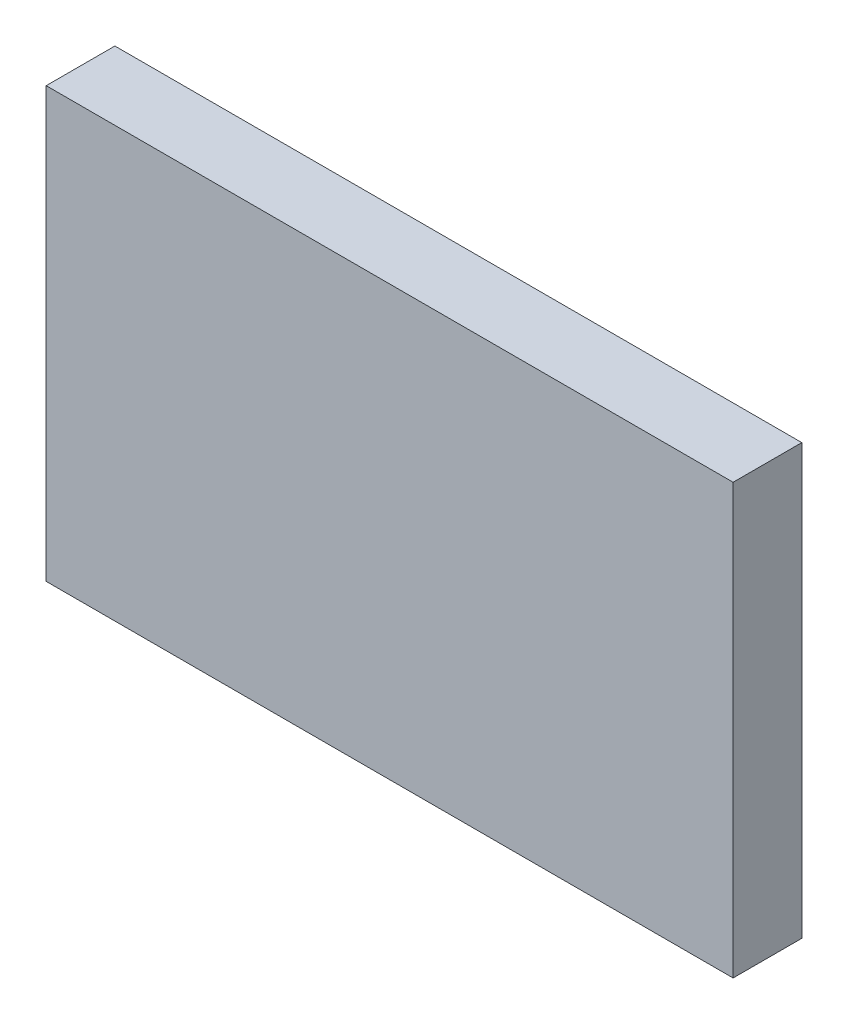
ISO-10303-21;
HEADER;
FILE_DESCRIPTION(('STEP AP214'),'2;1');
FILE_NAME('part.step','',(''),(''),'','','');
FILE_SCHEMA(('AUTOMOTIVE_DESIGN { 1 0 10303 214 1 1 1 1 }'));
ENDSEC;
DATA;
#1=APPLICATION_CONTEXT('core data for automotive mechanical design processes');
#2=APPLICATION_PROTOCOL_DEFINITION('international standard','automotive_design',2000,#1);
#3=PRODUCT_CONTEXT('',#1,'mechanical');
#4=PRODUCT('Part','Part','',(#3));
#5=PRODUCT_RELATED_PRODUCT_CATEGORY('part','',(#4));
#6=PRODUCT_DEFINITION_FORMATION('','',#4);
#7=PRODUCT_DEFINITION_CONTEXT('part definition',#1,'design');
#8=PRODUCT_DEFINITION('design','',#6,#7);
#9=PRODUCT_DEFINITION_SHAPE('','',#8);
#10=(LENGTH_UNIT() NAMED_UNIT(*) SI_UNIT(.MILLI.,.METRE.));
#11=(NAMED_UNIT(*) PLANE_ANGLE_UNIT() SI_UNIT($,.RADIAN.));
#12=(NAMED_UNIT(*) SI_UNIT($,.STERADIAN.) SOLID_ANGLE_UNIT());
#13=UNCERTAINTY_MEASURE_WITH_UNIT(LENGTH_MEASURE(1.E-05),#10,'distance_accuracy_value','');
#14=(GEOMETRIC_REPRESENTATION_CONTEXT(3) GLOBAL_UNCERTAINTY_ASSIGNED_CONTEXT((#13)) GLOBAL_UNIT_ASSIGNED_CONTEXT((#10,
#11,#12)) REPRESENTATION_CONTEXT('',''));
#15=CARTESIAN_POINT('',(0.,0.,0.));
#16=DIRECTION('',(0.,0.,1.));
#17=DIRECTION('',(1.,0.,0.));
#18=AXIS2_PLACEMENT_3D('',#15,#16,#17);
#19=CARTESIAN_POINT('',(-40.,-25.,8.));
#20=DIRECTION('',(1.,0.,0.));
#21=DIRECTION('',(0.,0.,-1.));
#22=AXIS2_PLACEMENT_3D('',#19,#20,#21);
#23=PLANE('',#22);
#24=DIRECTION('',(0.,-1.,0.));
#25=VECTOR('',#24,1.);
#26=CARTESIAN_POINT('',(-40.,-25.,0.));
#27=LINE('',#26,#25);
#28=CARTESIAN_POINT('',(-40.,25.,0.));
#29=VERTEX_POINT('',#28);
#30=CARTESIAN_POINT('',(-40.,-25.,0.));
#31=VERTEX_POINT('',#30);
#32=EDGE_CURVE('E97',#29,#31,#27,.T.);
#33=ORIENTED_EDGE('',*,*,#32,.T.);
#34=DIRECTION('',(0.,0.,-1.));
#35=VECTOR('',#34,1.);
#36=CARTESIAN_POINT('',(-40.,-25.,8.));
#37=LINE('',#36,#35);
#38=CARTESIAN_POINT('',(-40.,-25.,8.));
#39=VERTEX_POINT('',#38);
#40=EDGE_CURVE('E11',#39,#31,#37,.T.);
#41=ORIENTED_EDGE('',*,*,#40,.F.);
#42=DIRECTION('',(0.,-1.,0.));
#43=VECTOR('',#42,1.);
#44=CARTESIAN_POINT('',(-40.,-25.,8.));
#45=LINE('',#44,#43);
#46=CARTESIAN_POINT('',(-40.,25.,8.));
#47=VERTEX_POINT('',#46);
#48=EDGE_CURVE('E85',#47,#39,#45,.T.);
#49=ORIENTED_EDGE('',*,*,#48,.F.);
#50=DIRECTION('',(0.,0.,-1.));
#51=VECTOR('',#50,1.);
#52=CARTESIAN_POINT('',(-40.,25.,8.));
#53=LINE('',#52,#51);
#54=EDGE_CURVE('E93',#47,#29,#53,.T.);
#55=ORIENTED_EDGE('',*,*,#54,.T.);
#56=EDGE_LOOP('',(#33,#41,#49,#55));
#57=FACE_BOUND('',#56,.T.);
#58=ADVANCED_FACE('F34',(#57),#23,.F.);
#59=CARTESIAN_POINT('',(40.,-25.,8.));
#60=DIRECTION('',(0.,1.,0.));
#61=DIRECTION('',(-1.,0.,0.));
#62=AXIS2_PLACEMENT_3D('',#59,#60,#61);
#63=PLANE('',#62);
#64=DIRECTION('',(1.,0.,0.));
#65=VECTOR('',#64,1.);
#66=CARTESIAN_POINT('',(40.,-25.,0.));
#67=LINE('',#66,#65);
#68=CARTESIAN_POINT('',(40.,-25.,0.));
#69=VERTEX_POINT('',#68);
#70=EDGE_CURVE('E89',#31,#69,#67,.T.);
#71=ORIENTED_EDGE('',*,*,#70,.T.);
#72=DIRECTION('',(0.,0.,-1.));
#73=VECTOR('',#72,1.);
#74=CARTESIAN_POINT('',(40.,-25.,8.));
#75=LINE('',#74,#73);
#76=CARTESIAN_POINT('',(40.,-25.,8.));
#77=VERTEX_POINT('',#76);
#78=EDGE_CURVE('E42',#77,#69,#75,.T.);
#79=ORIENTED_EDGE('',*,*,#78,.F.);
#80=DIRECTION('',(1.,0.,0.));
#81=VECTOR('',#80,1.);
#82=CARTESIAN_POINT('',(40.,-25.,8.));
#83=LINE('',#82,#81);
#84=EDGE_CURVE('E80',#39,#77,#83,.T.);
#85=ORIENTED_EDGE('',*,*,#84,.F.);
#86=ORIENTED_EDGE('',*,*,#40,.T.);
#87=EDGE_LOOP('',(#71,#79,#85,#86));
#88=FACE_BOUND('',#87,.T.);
#89=ADVANCED_FACE('F88',(#88),#63,.F.);
#90=CARTESIAN_POINT('',(40.,-25.,8.));
#91=DIRECTION('',(-1.,0.,0.));
#92=DIRECTION('',(0.,0.,1.));
#93=AXIS2_PLACEMENT_3D('',#90,#91,#92);
#94=PLANE('',#93);
#95=DIRECTION('',(0.,1.,0.));
#96=VECTOR('',#95,1.);
#97=CARTESIAN_POINT('',(40.,-25.,0.));
#98=LINE('',#97,#96);
#99=CARTESIAN_POINT('',(40.,25.,0.));
#100=VERTEX_POINT('',#99);
#101=EDGE_CURVE('E67',#69,#100,#98,.T.);
#102=ORIENTED_EDGE('',*,*,#101,.T.);
#103=DIRECTION('',(0.,0.,-1.));
#104=VECTOR('',#103,1.);
#105=CARTESIAN_POINT('',(40.,25.,8.));
#106=LINE('',#105,#104);
#107=CARTESIAN_POINT('',(40.,25.,8.));
#108=VERTEX_POINT('',#107);
#109=EDGE_CURVE('E90',#108,#100,#106,.T.);
#110=ORIENTED_EDGE('',*,*,#109,.F.);
#111=DIRECTION('',(0.,1.,0.));
#112=VECTOR('',#111,1.);
#113=CARTESIAN_POINT('',(40.,-25.,8.));
#114=LINE('',#113,#112);
#115=EDGE_CURVE('E83',#77,#108,#114,.T.);
#116=ORIENTED_EDGE('',*,*,#115,.F.);
#117=ORIENTED_EDGE('',*,*,#78,.T.);
#118=EDGE_LOOP('',(#102,#110,#116,#117));
#119=FACE_BOUND('',#118,.T.);
#120=ADVANCED_FACE('F91',(#119),#94,.F.);
#121=CARTESIAN_POINT('',(40.,25.,8.));
#122=DIRECTION('',(0.,-1.,0.));
#123=DIRECTION('',(1.,0.,0.));
#124=AXIS2_PLACEMENT_3D('',#121,#122,#123);
#125=PLANE('',#124);
#126=DIRECTION('',(-1.,0.,0.));
#127=VECTOR('',#126,1.);
#128=CARTESIAN_POINT('',(40.,25.,0.));
#129=LINE('',#128,#127);
#130=EDGE_CURVE('E73',#100,#29,#129,.T.);
#131=ORIENTED_EDGE('',*,*,#130,.T.);
#132=ORIENTED_EDGE('',*,*,#54,.F.);
#133=DIRECTION('',(-1.,0.,0.));
#134=VECTOR('',#133,1.);
#135=CARTESIAN_POINT('',(40.,25.,8.));
#136=LINE('',#135,#134);
#137=EDGE_CURVE('E50',#108,#47,#136,.T.);
#138=ORIENTED_EDGE('',*,*,#137,.F.);
#139=ORIENTED_EDGE('',*,*,#109,.T.);
#140=EDGE_LOOP('',(#131,#132,#138,#139));
#141=FACE_BOUND('',#140,.T.);
#142=ADVANCED_FACE('F104',(#141),#125,.F.);
#143=CARTESIAN_POINT('',(0.,0.,8.));
#144=DIRECTION('',(0.,0.,1.));
#145=DIRECTION('',(1.,0.,0.));
#146=AXIS2_PLACEMENT_3D('',#143,#144,#145);
#147=PLANE('',#146);
#148=ORIENTED_EDGE('',*,*,#48,.T.);
#149=ORIENTED_EDGE('',*,*,#84,.T.);
#150=ORIENTED_EDGE('',*,*,#115,.T.);
#151=ORIENTED_EDGE('',*,*,#137,.T.);
#152=EDGE_LOOP('',(#148,#149,#150,#151));
#153=FACE_BOUND('',#152,.T.);
#154=ADVANCED_FACE('F81',(#153),#147,.T.);
#155=CARTESIAN_POINT('',(0.,0.,0.));
#156=DIRECTION('',(0.,0.,1.));
#157=DIRECTION('',(1.,0.,0.));
#158=AXIS2_PLACEMENT_3D('',#155,#156,#157);
#159=PLANE('',#158);
#160=ORIENTED_EDGE('',*,*,#32,.F.);
#161=ORIENTED_EDGE('',*,*,#130,.F.);
#162=ORIENTED_EDGE('',*,*,#101,.F.);
#163=ORIENTED_EDGE('',*,*,#70,.F.);
#164=EDGE_LOOP('',(#160,#161,#162,#163));
#165=FACE_BOUND('',#164,.T.);
#166=ADVANCED_FACE('F107',(#165),#159,.F.);
#167=CLOSED_SHELL('',(#58,#89,#120,#142,#154,#166));
#168=MANIFOLD_SOLID_BREP('B2',#167);
#169=ADVANCED_BREP_SHAPE_REPRESENTATION('',(#18,#168),#14);
#170=SHAPE_DEFINITION_REPRESENTATION(#9,#169);
ENDSEC;
END-ISO-10303-21;
